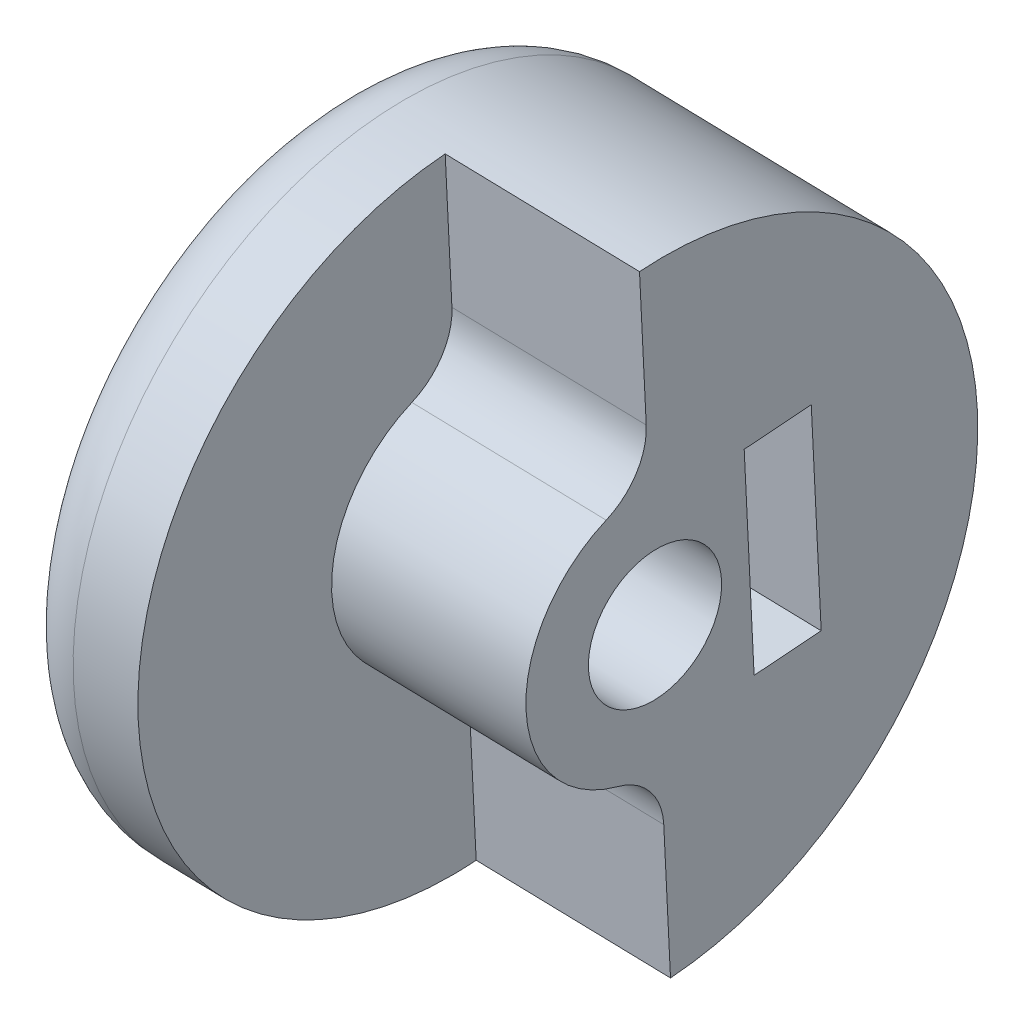
ISO-10303-21;
HEADER;
FILE_DESCRIPTION(('STEP AP214'),'2;1');
FILE_NAME('part.step','',(''),(''),'','','');
FILE_SCHEMA(('AUTOMOTIVE_DESIGN { 1 0 10303 214 1 1 1 1 }'));
ENDSEC;
DATA;
#1=APPLICATION_CONTEXT('core data for automotive mechanical design processes');
#2=APPLICATION_PROTOCOL_DEFINITION('international standard','automotive_design',2000,#1);
#3=PRODUCT_CONTEXT('',#1,'mechanical');
#4=PRODUCT('Part','Part','',(#3));
#5=PRODUCT_RELATED_PRODUCT_CATEGORY('part','',(#4));
#6=PRODUCT_DEFINITION_FORMATION('','',#4);
#7=PRODUCT_DEFINITION_CONTEXT('part definition',#1,'design');
#8=PRODUCT_DEFINITION('design','',#6,#7);
#9=PRODUCT_DEFINITION_SHAPE('','',#8);
#10=(LENGTH_UNIT() NAMED_UNIT(*) SI_UNIT(.MILLI.,.METRE.));
#11=(NAMED_UNIT(*) PLANE_ANGLE_UNIT() SI_UNIT($,.RADIAN.));
#12=(NAMED_UNIT(*) SI_UNIT($,.STERADIAN.) SOLID_ANGLE_UNIT());
#13=UNCERTAINTY_MEASURE_WITH_UNIT(LENGTH_MEASURE(1.E-05),#10,'distance_accuracy_value','');
#14=(GEOMETRIC_REPRESENTATION_CONTEXT(3) GLOBAL_UNCERTAINTY_ASSIGNED_CONTEXT((#13)) GLOBAL_UNIT_ASSIGNED_CONTEXT((#10,
#11,#12)) REPRESENTATION_CONTEXT('',''));
#15=CARTESIAN_POINT('',(0.,0.,0.));
#16=DIRECTION('',(0.,0.,1.));
#17=DIRECTION('',(1.,0.,0.));
#18=AXIS2_PLACEMENT_3D('',#15,#16,#17);
#19=CARTESIAN_POINT('',(326.908154622549,6183.60035002082,3267.18552695112));
#20=DIRECTION('',(0.,-0.074828911130049,0.997196386906356));
#21=DIRECTION('',(0.,-0.997196386906356,-0.074828911130049));
#22=AXIS2_PLACEMENT_3D('',#19,#20,#21);
#23=CYLINDRICAL_SURFACE('',#22,2.24789999999997);
#24=CARTESIAN_POINT('',(326.908154622549,6181.53719533492,3264.63932390312));
#25=CARTESIAN_POINT('',(326.801592501721,6181.53700135156,3264.64200237666));
#26=CARTESIAN_POINT('',(326.694797081448,6181.54495973496,3264.63803854739));
#27=CARTESIAN_POINT('',(326.484722799122,6181.57660648519,3264.61766231055));
#28=CARTESIAN_POINT('',(326.381450478426,6181.60032259846,3264.60122793739));
#29=CARTESIAN_POINT('',(326.182305765981,6181.66145041657,3264.55916119703));
#30=CARTESIAN_POINT('',(326.086371729537,6181.69872813671,3264.53361886119));
#31=CARTESIAN_POINT('',(325.902002458964,6181.78526908347,3264.47675341127));
#32=CARTESIAN_POINT('',(325.813569522156,6181.8345359642,3264.44542853547));
#33=CARTESIAN_POINT('',(325.631912956457,6181.95203187914,3264.37512141387));
#34=CARTESIAN_POINT('',(325.539989196894,6182.02200214434,3264.33569771403));
#35=CARTESIAN_POINT('',(325.367308982668,6182.17484598418,3264.25712971097));
#36=CARTESIAN_POINT('',(325.286565157015,6182.25773392985,3264.21798577033));
#37=CARTESIAN_POINT('',(325.123033863751,6182.45244914375,3264.13618335167));
#38=CARTESIAN_POINT('',(325.042806518761,6182.56677952732,3264.09428353066));
#39=CARTESIAN_POINT('',(324.902665009231,6182.81026440781,3264.02088699577));
#40=CARTESIAN_POINT('',(324.842718640997,6182.93939496314,3263.9893737913));
#41=CARTESIAN_POINT('',(324.758585672514,6183.17539495544,3263.94731971956));
#42=CARTESIAN_POINT('',(324.729217586104,6183.27984306849,3263.93351589625));
#43=CARTESIAN_POINT('',(324.685394353934,6183.49263130316,3263.91593898018));
#44=CARTESIAN_POINT('',(324.670926588781,6183.6009680508,3263.91215739512));
#45=CARTESIAN_POINT('',(324.657771776071,6183.81875320891,3263.91545950715));
#46=CARTESIAN_POINT('',(324.659128253464,6183.92820385776,3263.92257312512));
#47=CARTESIAN_POINT('',(324.6777334189,6184.14449905688,3263.94756845602));
#48=CARTESIAN_POINT('',(324.694984999177,6184.25134312923,3263.96545212844));
#49=CARTESIAN_POINT('',(324.743467468728,6184.45519595152,3264.00994287378));
#50=CARTESIAN_POINT('',(324.774119741904,6184.55242644919,3264.03617778873));
#51=CARTESIAN_POINT('',(324.847874663732,6184.73961495047,3264.09591098513));
#52=CARTESIAN_POINT('',(324.890979700422,6184.82957155495,3264.1294106594));
#53=CARTESIAN_POINT('',(324.992784625307,6185.00907613861,3264.20522132357));
#54=CARTESIAN_POINT('',(325.052576305487,6185.09777508312,3264.24806682379));
#55=CARTESIAN_POINT('',(325.18363017663,6185.26409147076,3264.33760499373));
#56=CARTESIAN_POINT('',(325.254902574354,6185.34169893623,3264.38430106854));
#57=CARTESIAN_POINT('',(325.420761912667,6185.49771775261,3264.48697042373));
#58=CARTESIAN_POINT('',(325.517250411635,6185.57397099441,3264.54315781194));
#59=CARTESIAN_POINT('',(325.72292636564,6185.70998827938,3264.65233437216));
#60=CARTESIAN_POINT('',(325.832115378429,6185.76975029683,3264.70532315065));
#61=CARTESIAN_POINT('',(326.04129986783,6185.86233695339,3264.79338010726));
#62=CARTESIAN_POINT('',(326.139357692101,6185.89808363408,3264.82995489665));
#63=CARTESIAN_POINT('',(326.342324072143,6185.95660799428,3264.89301547523));
#64=CARTESIAN_POINT('',(326.447220999377,6185.97940707896,3264.9195178921));
#65=CARTESIAN_POINT('',(326.663005181575,6186.01092744208,3264.95863521625));
#66=CARTESIAN_POINT('',(326.773945637088,6186.01949110805,3264.97109415622));
#67=CARTESIAN_POINT('',(326.996521515907,6186.02116084276,3264.97899101948));
#68=CARTESIAN_POINT('',(327.108156311079,6186.0142792926,3264.97444257418));
#69=CARTESIAN_POINT('',(327.310161182421,6185.98786231835,3264.95132474825));
#70=CARTESIAN_POINT('',(327.401109436546,6185.97049247532,3264.93507846584));
#71=CARTESIAN_POINT('',(327.578413455694,6185.92600261897,3264.89338118501));
#72=CARTESIAN_POINT('',(327.664763974513,6185.89887173047,3264.8679199196));
#73=CARTESIAN_POINT('',(327.866877727703,6185.82243946869,3264.7982317297));
#74=CARTESIAN_POINT('',(327.979754989732,6185.76861248295,3264.75061502669));
#75=CARTESIAN_POINT('',(328.192886718394,6185.64476553595,3264.64855843431));
#76=CARTESIAN_POINT('',(328.293117923029,6185.57471638658,3264.59410632803));
#77=CARTESIAN_POINT('',(328.481712372192,6185.41794906482,3264.48268004594));
#78=CARTESIAN_POINT('',(328.569827337068,6185.33095155502,3264.42567803733));
#79=CARTESIAN_POINT('',(328.730360695437,6185.14186858893,3264.31485192362));
#80=CARTESIAN_POINT('',(328.80279896524,6185.03980251755,3264.2610238581));
#81=CARTESIAN_POINT('',(328.92079786094,6184.83692685845,3264.1678729962));
#82=CARTESIAN_POINT('',(328.96869971279,6184.73793420825,3264.12757433765));
#83=CARTESIAN_POINT('',(329.049269504324,6184.5310845872,3264.05522505858));
#84=CARTESIAN_POINT('',(329.081946256191,6184.42323278659,3264.02316967173));
#85=CARTESIAN_POINT('',(329.130412212972,6184.20053350462,3263.96951906837));
#86=CARTESIAN_POINT('',(329.146101840351,6184.08564890005,3263.94798593201));
#87=CARTESIAN_POINT('',(329.159091157402,6183.85321915758,3263.91730856518));
#88=CARTESIAN_POINT('',(329.156398923672,6183.73567521076,3263.9081588958));
#89=CARTESIAN_POINT('',(329.133929096206,6183.51388209455,3263.9028531634));
#90=CARTESIAN_POINT('',(329.115885204089,6183.40947786991,3263.90549034932));
#91=CARTESIAN_POINT('',(329.065916290158,6183.20478079,3263.92036397312));
#92=CARTESIAN_POINT('',(329.033988922053,6183.1044886328,3263.9326020338));
#93=CARTESIAN_POINT('',(328.956530145964,6182.90742944018,3263.96580392248));
#94=CARTESIAN_POINT('',(328.910628837796,6182.81085075933,3263.98701202959));
#95=CARTESIAN_POINT('',(328.807240654171,6182.62606124605,3264.03625647277));
#96=CARTESIAN_POINT('',(328.749751427457,6182.53785211721,3264.06429419485));
#97=CARTESIAN_POINT('',(328.615180652779,6182.35822283063,3264.12970157568));
#98=CARTESIAN_POINT('',(328.536452526709,6182.26831817971,3264.16784066032));
#99=CARTESIAN_POINT('',(328.367003711242,6182.1018432549,3264.24708702399));
#100=CARTESIAN_POINT('',(328.276259151143,6182.02530024454,3264.28820013517));
#101=CARTESIAN_POINT('',(328.069219224722,6181.87623655246,3264.37579037961));
#102=CARTESIAN_POINT('',(327.951136622067,6181.80609469243,3264.42213323403));
#103=CARTESIAN_POINT('',(327.701771128719,6181.68791047372,3264.50653934301));
#104=CARTESIAN_POINT('',(327.570531115215,6181.63979900407,3264.54462828985));
#105=CARTESIAN_POINT('',(327.349371083599,6181.58280613649,3264.59280267626));
#106=CARTESIAN_POINT('',(327.262614039742,6181.56596867252,3264.6080307229));
#107=CARTESIAN_POINT('',(327.086675521831,6181.54325112427,3264.6301635491));
#108=CARTESIAN_POINT('',(326.99749706838,6181.53735797196,3264.6370782517));
#109=CARTESIAN_POINT('',(326.908154622549,6181.53719533492,3264.63932390312));
#110=B_SPLINE_CURVE_WITH_KNOTS('',3,(#24,#25,#26,#27,#28,#29,#30,#31,#32,#33,#34,#35,#36,#37,
#38,#39,#40,#41,#42,#43,#44,#45,#46,#47,#48,#49,#50,#51,#52,#53,#54,#55,#56,#57,#58,#59,#60,#61,
#62,#63,#64,#65,#66,#67,#68,#69,#70,#71,#72,#73,#74,#75,#76,#77,#78,#79,#80,#81,#82,#83,#84,#85,
#86,#87,#88,#89,#90,#91,#92,#93,#94,#95,#96,#97,#98,#99,#100,#101,#102,#103,#104,#105,#106,#107,
#108,#109),.UNSPECIFIED.,.T.,.F.,(4,2,2,2,2,2,2,2,2,2,2,2,2,2,2,2,2,2,2,2,2,2,2,2,2,2,2,2,2,2,2,
2,2,2,2,2,2,2,2,2,2,2,4),(0.,0.319379632697999,0.639323129553901,0.95618790379326,
1.27314937467175,1.63807175667907,2.00340305453204,2.43857403087845,2.87305073000711,
3.19977683762745,3.52622600597208,3.85357329161145,4.18098015231262,4.49546475794108,
4.81000971160984,5.15440688942225,5.49911195567997,5.90311212604608,6.30716190043551,
6.63775271146785,6.96779538137788,7.30146847331985,7.63487418403738,7.91572597280686,
8.19689164398122,8.59619305429314,8.99621857716629,9.40350089364732,9.81026375610438,
10.1601938246728,10.5099211037268,10.8616875457264,11.2132994389808,11.5297851916631,
11.8463244508841,12.1721035495618,12.4979488174217,12.872845074822,13.2484975618772,
13.681235158515,14.1126057650117,14.3806962570215,14.648466430065),.UNSPECIFIED.);
#111=CARTESIAN_POINT('',(326.908154622549,6181.53719533492,3264.63932390312));
#112=VERTEX_POINT('',#111);
#113=EDGE_CURVE('E159',#112,#112,#110,.T.);
#114=ORIENTED_EDGE('',*,*,#113,.F.);
#115=EDGE_LOOP('',(#114));
#116=FACE_BOUND('',#115,.T.);
#117=CARTESIAN_POINT('',(326.908154622549,6183.94721943836,3262.56302309962));
#118=DIRECTION('',(0.,0.0748289111300478,-0.997196386906356));
#119=DIRECTION('',(0.,0.997196386906356,0.0748289111300478));
#120=AXIS2_PLACEMENT_3D('',#117,#118,#119);
#121=CIRCLE('',#120,2.24789999999997);
#122=CARTESIAN_POINT('',(326.908154622549,6186.18881719649,3262.73123100895));
#123=VERTEX_POINT('',#122);
#124=EDGE_CURVE('E154',#123,#123,#121,.F.);
#125=ORIENTED_EDGE('',*,*,#124,.F.);
#126=EDGE_LOOP('',(#125));
#127=FACE_BOUND('',#126,.T.);
#128=ADVANCED_FACE('F34',(#116,#127),#23,.F.);
#129=CARTESIAN_POINT('',(320.560448237722,6183.77052809832,3267.19829699361));
#130=DIRECTION('',(-0.999638800759929,0.0267996972431761,0.00201103031422804));
#131=DIRECTION('',(0.00201175288836806,0.,0.999997976423111));
#132=AXIS2_PLACEMENT_3D('',#129,#130,#131);
#133=TOROIDAL_SURFACE('',#132,12.6999999999996,3.175);
#134=CARTESIAN_POINT('',(317.386595045309,6183.85561713707,3267.20468201486));
#135=DIRECTION('',(0.999638800759929,-0.0267996972431761,-0.00201103031422804));
#136=DIRECTION('',(0.0267997514355812,0.999640822157134,-6.29417777740183E-13));
#137=AXIS2_PLACEMENT_3D('',#134,#135,#136);
#138=CIRCLE('',#137,12.7000000000013);
#139=CARTESIAN_POINT('',(317.726951888541,6196.55105557846,3267.20468201485));
#140=VERTEX_POINT('',#139);
#141=EDGE_CURVE('E222',#140,#140,#138,.T.);
#142=ORIENTED_EDGE('',*,*,#141,.T.);
#143=EDGE_LOOP('',(#142));
#144=FACE_BOUND('',#143,.T.);
#145=CARTESIAN_POINT('',(320.560448237721,6183.77052809833,3267.1982969936));
#146=DIRECTION('',(-0.999638800759929,0.0267996972431899,0.00201103031419884));
#147=DIRECTION('',(-0.0267997514355973,-0.999640822157134,0.));
#148=AXIS2_PLACEMENT_3D('',#145,#146,#147);
#149=CIRCLE('',#148,15.8749999999998);
#150=CARTESIAN_POINT('',(320.135002183681,6167.90123004658,3267.1982969936));
#151=VERTEX_POINT('',#150);
#152=EDGE_CURVE('E249',#151,#151,#149,.T.);
#153=ORIENTED_EDGE('',*,*,#152,.T.);
#154=EDGE_LOOP('',(#153));
#155=FACE_BOUND('',#154,.T.);
#156=ADVANCED_FACE('F176',(#144,#155),#133,.T.);
#157=CARTESIAN_POINT('',(321.466716884046,6334.52205534716,3287.50928548159));
#158=DIRECTION('',(-0.999638800759929,0.0267996972431761,0.00201103031422804));
#159=DIRECTION('',(-0.0267997514355835,-0.999640822157134,0.));
#160=AXIS2_PLACEMENT_3D('',#157,#158,#159);
#161=PLANE('',#160);
#162=ORIENTED_EDGE('',*,*,#141,.F.);
#163=EDGE_LOOP('',(#162));
#164=FACE_BOUND('',#163,.T.);
#165=ADVANCED_FACE('F36',(#164),#161,.T.);
#166=CARTESIAN_POINT('',(327.814423268872,6334.35187726969,3287.49651543908));
#167=DIRECTION('',(-0.999638800759929,0.0267996972431761,0.00201103031422804));
#168=DIRECTION('',(-0.0267997514355835,-0.999640822157134,0.));
#169=AXIS2_PLACEMENT_3D('',#166,#167,#168);
#170=PLANE('',#169);
#171=CARTESIAN_POINT('',(323.734301430129,6183.68543905958,3267.19191197235));
#172=DIRECTION('',(0.999638800759928,-0.0267996972432226,-0.00201103031425039));
#173=DIRECTION('',(0.02679975143563,0.999640822157133,0.));
#174=AXIS2_PLACEMENT_3D('',#171,#172,#173);
#175=CIRCLE('',#174,6.3499999999999);
#176=CARTESIAN_POINT('',(323.895197951865,6189.49494745749,3269.75047103633));
#177=VERTEX_POINT('',#176);
#178=CARTESIAN_POINT('',(323.573404908396,6177.55915493788,3268.85481761295));
#179=VERTEX_POINT('',#178);
#180=EDGE_CURVE('E280',#177,#179,#175,.T.);
#181=ORIENTED_EDGE('',*,*,#180,.F.);
#182=CARTESIAN_POINT('',(323.975646212733,6192.39970165645,3271.02975056831));
#183=DIRECTION('',(0.999638800759928,-0.0267996972432226,-0.00201103031425039));
#184=DIRECTION('',(0.02679975143563,0.999640822157133,0.));
#185=AXIS2_PLACEMENT_3D('',#182,#183,#184);
#186=CIRCLE('',#185,3.175);
#187=CARTESIAN_POINT('',(323.975646212737,6192.63728344928,3267.86365203989));
#188=VERTEX_POINT('',#187);
#189=EDGE_CURVE('E274',#188,#177,#186,.F.);
#190=ORIENTED_EDGE('',*,*,#189,.F.);
#191=DIRECTION('',(-0.0268750444695199,-0.996836200329253,-0.07480188298364));
#192=VECTOR('',#191,1.);
#193=CARTESIAN_POINT('',(324.160942761093,6199.51021373979,3268.37939186472));
#194=LINE('',#193,#192);
#195=CARTESIAN_POINT('',(324.160942761093,6199.51021373981,3268.37939186472));
#196=VERTEX_POINT('',#195);
#197=EDGE_CURVE('E272',#196,#188,#194,.T.);
#198=ORIENTED_EDGE('',*,*,#197,.F.);
#199=CARTESIAN_POINT('',(323.734301430138,6183.68543905958,3267.19191197235));
#200=DIRECTION('',(-0.999638800759929,0.0267996972431899,0.00201103031419884));
#201=DIRECTION('',(-0.0267997514355973,-0.999640822157134,0.));
#202=AXIS2_PLACEMENT_3D('',#199,#200,#201);
#203=CIRCLE('',#202,15.8749999999998);
#204=CARTESIAN_POINT('',(323.307660099182,6167.86066437935,3266.00443207999));
#205=VERTEX_POINT('',#204);
#206=EDGE_CURVE('E246',#205,#196,#203,.T.);
#207=ORIENTED_EDGE('',*,*,#206,.F.);
#208=DIRECTION('',(-0.0268750444695199,-0.996836200329253,-0.07480188298364));
#209=VECTOR('',#208,1.);
#210=CARTESIAN_POINT('',(323.492956647532,6174.73359466986,3266.52017190482));
#211=LINE('',#210,#209);
#212=CARTESIAN_POINT('',(323.492956647532,6174.73359466986,3266.52017190482));
#213=VERTEX_POINT('',#212);
#214=EDGE_CURVE('E218',#213,#205,#211,.T.);
#215=ORIENTED_EDGE('',*,*,#214,.F.);
#216=CARTESIAN_POINT('',(323.492956647533,6174.49601287703,3269.68627043325));
#217=DIRECTION('',(-0.999638800759928,0.0267996972432226,0.00201103031425039));
#218=DIRECTION('',(-0.02679975143563,-0.999640822157133,0.));
#219=AXIS2_PLACEMENT_3D('',#216,#217,#218);
#220=CIRCLE('',#219,3.175);
#221=EDGE_CURVE('E278',#179,#213,#220,.T.);
#222=ORIENTED_EDGE('',*,*,#221,.F.);
#223=EDGE_LOOP('',(#181,#190,#198,#207,#215,#222));
#224=FACE_BOUND('',#223,.T.);
#225=ADVANCED_FACE('F312',(#224),#170,.F.);
#226=CARTESIAN_POINT('',(324.160942761093,6199.51021373979,3268.37939186472));
#227=DIRECTION('',(0.,-0.0748289111294746,0.997196386906399));
#228=DIRECTION('',(0.,-0.997196386906399,-0.0748289111294746));
#229=AXIS2_PLACEMENT_3D('',#226,#227,#228);
#230=PLANE('',#229);
#231=DIRECTION('',(-0.999638800759929,0.0267996972431738,0.00201103031419689));
#232=VECTOR('',#231,1.);
#233=CARTESIAN_POINT('',(333.682502338332,6199.25494662357,3268.36023680098));
#234=LINE('',#233,#232);
#235=CARTESIAN_POINT('',(333.682502338332,6199.25494662357,3268.36023680097));
#236=VERTEX_POINT('',#235);
#237=EDGE_CURVE('E244',#236,#196,#234,.T.);
#238=ORIENTED_EDGE('',*,*,#237,.T.);
#239=ORIENTED_EDGE('',*,*,#197,.T.);
#240=DIRECTION('',(0.999638800759944,-0.0267996972426213,-0.00201103031419741));
#241=VECTOR('',#240,1.);
#242=CARTESIAN_POINT('',(323.975646212741,6192.63728344928,3267.86365203988));
#243=LINE('',#242,#241);
#244=CARTESIAN_POINT('',(333.497205789977,6192.38201633304,3267.84449697614));
#245=VERTEX_POINT('',#244);
#246=EDGE_CURVE('E268',#188,#245,#243,.T.);
#247=ORIENTED_EDGE('',*,*,#246,.T.);
#248=DIRECTION('',(-0.0268750444697461,-0.996836200329281,-0.0748018829831912));
#249=VECTOR('',#248,1.);
#250=CARTESIAN_POINT('',(333.682502338331,6199.25494662355,3268.36023680097));
#251=LINE('',#250,#249);
#252=EDGE_CURVE('E264',#236,#245,#251,.T.);
#253=ORIENTED_EDGE('',*,*,#252,.F.);
#254=EDGE_LOOP('',(#238,#239,#247,#253));
#255=FACE_BOUND('',#254,.T.);
#256=ADVANCED_FACE('F307',(#255),#230,.T.);
#257=CARTESIAN_POINT('',(333.255861007374,6183.43017194332,3267.17275690863));
#258=DIRECTION('',(0.999638800759929,-0.0267996972431761,-0.00201103031422804));
#259=DIRECTION('',(0.0267997514355835,0.999640822157134,0.));
#260=AXIS2_PLACEMENT_3D('',#257,#258,#259);
#261=PLANE('',#260);
#262=DIRECTION('',(-0.0268750444697404,-0.996836200329198,-0.0748018829843015));
#263=VECTOR('',#262,1.);
#264=CARTESIAN_POINT('',(333.363374622775,6188.01196964483,3259.55675552042));
#265=LINE('',#264,#263);
#266=CARTESIAN_POINT('',(333.392386233281,6189.08805432309,3259.63750415312));
#267=VERTEX_POINT('',#266);
#268=CARTESIAN_POINT('',(333.119335781468,6178.96019852775,3258.877517022));
#269=VERTEX_POINT('',#268);
#270=EDGE_CURVE('E271',#267,#269,#265,.T.);
#271=ORIENTED_EDGE('',*,*,#270,.T.);
#272=DIRECTION('',(0.,0.0748289111300486,-0.997196386906356));
#273=VECTOR('',#272,1.);
#274=CARTESIAN_POINT('',(333.119335781468,6178.36624404565,3266.79276334307));
#275=LINE('',#274,#273);
#276=CARTESIAN_POINT('',(333.119335781468,6178.7131134632,3262.17025949156));
#277=VERTEX_POINT('',#276);
#278=EDGE_CURVE('E11',#277,#269,#275,.T.);
#279=ORIENTED_EDGE('',*,*,#278,.F.);
#280=DIRECTION('',(0.0268750444697427,0.996836200329204,0.0748018829842135));
#281=VECTOR('',#280,1.);
#282=CARTESIAN_POINT('',(333.255861007374,6183.77704136086,3262.55025305712));
#283=LINE('',#282,#281);
#284=CARTESIAN_POINT('',(333.392386233281,6188.84096925854,3262.93024662268));
#285=VERTEX_POINT('',#284);
#286=EDGE_CURVE('E156',#277,#285,#283,.T.);
#287=ORIENTED_EDGE('',*,*,#286,.T.);
#288=DIRECTION('',(0.,-0.0748289111300486,0.997196386906356));
#289=VECTOR('',#288,1.);
#290=CARTESIAN_POINT('',(333.392386233281,6188.494099841,3267.55275047419));
#291=LINE('',#290,#289);
#292=EDGE_CURVE('E44',#267,#285,#291,.T.);
#293=ORIENTED_EDGE('',*,*,#292,.F.);
#294=EDGE_LOOP('',(#271,#279,#287,#293));
#295=FACE_BOUND('',#294,.T.);
#296=CARTESIAN_POINT('',(333.255861007374,6183.43017194332,3267.17275690863));
#297=DIRECTION('',(-0.999638800759929,0.02679969724319,0.00201103031424361));
#298=DIRECTION('',(-0.0267997514355973,-0.999640822157134,0.));
#299=AXIS2_PLACEMENT_3D('',#296,#297,#298);
#300=CIRCLE('',#299,3.27660000000038);
#301=CARTESIAN_POINT('',(333.16804894182,6180.15474882544,3267.17275690863));
#302=VERTEX_POINT('',#301);
#303=EDGE_CURVE('E267',#302,#302,#300,.T.);
#304=ORIENTED_EDGE('',*,*,#303,.T.);
#305=EDGE_LOOP('',(#304));
#306=FACE_BOUND('',#305,.T.);
#307=DIRECTION('',(0.0268750444698936,0.996836200329247,0.0748018829835848));
#308=VECTOR('',#307,1.);
#309=CARTESIAN_POINT('',(332.829219676417,6167.60539726311,3265.98527701625));
#310=LINE('',#309,#308);
#311=CARTESIAN_POINT('',(332.829219676416,6167.60539726311,3265.98527701625));
#312=VERTEX_POINT('',#311);
#313=CARTESIAN_POINT('',(333.014516224771,6174.47832755362,3266.50101684108));
#314=VERTEX_POINT('',#313);
#315=EDGE_CURVE('E269',#312,#314,#310,.T.);
#316=ORIENTED_EDGE('',*,*,#315,.F.);
#317=CARTESIAN_POINT('',(333.255861007375,6183.43017194334,3267.1727569086));
#318=DIRECTION('',(-0.999638800759929,0.0267996972431899,0.00201103031419884));
#319=DIRECTION('',(-0.0267997514355973,-0.999640822157134,0.));
#320=AXIS2_PLACEMENT_3D('',#317,#318,#319);
#321=CIRCLE('',#320,15.8749999999998);
#322=EDGE_CURVE('E236',#236,#312,#321,.T.);
#323=ORIENTED_EDGE('',*,*,#322,.F.);
#324=ORIENTED_EDGE('',*,*,#252,.T.);
#325=CARTESIAN_POINT('',(333.497205789977,6192.14443454021,3271.01059550457));
#326=DIRECTION('',(0.999638800759928,-0.0267996972432226,-0.00201103031425039));
#327=DIRECTION('',(0.02679975143563,0.999640822157133,0.));
#328=AXIS2_PLACEMENT_3D('',#325,#326,#327);
#329=CIRCLE('',#328,3.175);
#330=CARTESIAN_POINT('',(333.416757529111,6189.23968034125,3269.73131597259));
#331=VERTEX_POINT('',#330);
#332=EDGE_CURVE('E270',#245,#331,#329,.F.);
#333=ORIENTED_EDGE('',*,*,#332,.T.);
#334=CARTESIAN_POINT('',(333.255861007376,6183.43017194334,3267.1727569086));
#335=DIRECTION('',(0.999638800759928,-0.0267996972432226,-0.00201103031425039));
#336=DIRECTION('',(0.02679975143563,0.999640822157133,0.));
#337=AXIS2_PLACEMENT_3D('',#334,#335,#336);
#338=CIRCLE('',#337,6.3499999999999);
#339=CARTESIAN_POINT('',(333.09496448564,6177.30388782163,3268.83566254921));
#340=VERTEX_POINT('',#339);
#341=EDGE_CURVE('E290',#331,#340,#338,.T.);
#342=ORIENTED_EDGE('',*,*,#341,.T.);
#343=CARTESIAN_POINT('',(333.014516224772,6174.24074576079,3269.66711536951));
#344=DIRECTION('',(-0.999638800759928,0.0267996972432226,0.00201103031425039));
#345=DIRECTION('',(-0.02679975143563,-0.999640822157133,0.));
#346=AXIS2_PLACEMENT_3D('',#343,#344,#345);
#347=CIRCLE('',#346,3.175);
#348=EDGE_CURVE('E292',#340,#314,#347,.T.);
#349=ORIENTED_EDGE('',*,*,#348,.T.);
#350=EDGE_LOOP('',(#316,#323,#324,#333,#342,#349));
#351=FACE_BOUND('',#350,.T.);
#352=ADVANCED_FACE('F304',(#295,#306,#351),#261,.T.);
#353=CARTESIAN_POINT('',(333.363374622776,6188.01196964483,3259.55675552042));
#354=DIRECTION('',(0.,0.0748289111288952,-0.997196386906443));
#355=DIRECTION('',(0.,0.997196386906443,0.0748289111288952));
#356=AXIS2_PLACEMENT_3D('',#353,#354,#355);
#357=PLANE('',#356);
#358=DIRECTION('',(-0.999638800759923,0.0267996972433878,0.00201103031427132));
#359=VECTOR('',#358,1.);
#360=CARTESIAN_POINT('',(333.838880165489,6178.94090798837,3258.87606947358));
#361=LINE('',#360,#359);
#362=CARTESIAN_POINT('',(323.83974940463,6179.20897849232,3258.89618529447));
#363=VERTEX_POINT('',#362);
#364=EDGE_CURVE('E140',#269,#363,#361,.T.);
#365=ORIENTED_EDGE('',*,*,#364,.F.);
#366=ORIENTED_EDGE('',*,*,#270,.F.);
#367=DIRECTION('',(0.999638800759928,-0.0267996972432089,-0.00201103031422682));
#368=VECTOR('',#367,1.);
#369=CARTESIAN_POINT('',(324.112799856442,6189.33683428767,3259.65617242559));
#370=LINE('',#369,#368);
#371=CARTESIAN_POINT('',(324.112799856442,6189.33683428767,3259.65617242559));
#372=VERTEX_POINT('',#371);
#373=EDGE_CURVE('E142',#372,#267,#370,.T.);
#374=ORIENTED_EDGE('',*,*,#373,.F.);
#375=DIRECTION('',(0.523093871618623,0.84988562427544,0.0637748157581389));
#376=VECTOR('',#375,1.);
#377=CARTESIAN_POINT('',(321.044394638524,6184.35150827708,3259.28207709001));
#378=LINE('',#377,#376);
#379=CARTESIAN_POINT('',(321.044394638524,6184.35150827708,3259.28207709001));
#380=VERTEX_POINT('',#379);
#381=EDGE_CURVE('E148',#380,#372,#378,.T.);
#382=ORIENTED_EDGE('',*,*,#381,.F.);
#383=DIRECTION('',(-0.476544929141307,0.876685321518646,0.0657858460723405));
#384=VECTOR('',#383,1.);
#385=CARTESIAN_POINT('',(323.83974940463,6179.20897849232,3258.89618529447));
#386=LINE('',#385,#384);
#387=EDGE_CURVE('E121',#363,#380,#386,.T.);
#388=ORIENTED_EDGE('',*,*,#387,.F.);
#389=EDGE_LOOP('',(#365,#366,#374,#382,#388));
#390=FACE_BOUND('',#389,.T.);
#391=CARTESIAN_POINT('',(326.908154622549,6184.19430450291,3259.27028063004));
#392=DIRECTION('',(0.,0.0748289111288952,-0.997196386906443));
#393=DIRECTION('',(0.,0.997196386906443,0.0748289111288952));
#394=AXIS2_PLACEMENT_3D('',#391,#392,#393);
#395=CIRCLE('',#394,2.24789999999997);
#396=CARTESIAN_POINT('',(326.908154622549,6186.43590226104,3259.43848853936));
#397=VERTEX_POINT('',#396);
#398=EDGE_CURVE('E168',#397,#397,#395,.T.);
#399=ORIENTED_EDGE('',*,*,#398,.T.);
#400=EDGE_LOOP('',(#399));
#401=FACE_BOUND('',#400,.T.);
#402=ADVANCED_FACE('F315',(#390,#401),#357,.F.);
#403=CARTESIAN_POINT('',(324.160942761093,6199.51021373979,3268.37939186472));
#404=DIRECTION('',(0.,-0.0748289111294746,0.997196386906399));
#405=DIRECTION('',(0.,-0.997196386906399,-0.0748289111294746));
#406=AXIS2_PLACEMENT_3D('',#403,#404,#405);
#407=PLANE('',#406);
#408=DIRECTION('',(-0.999638800759929,0.0267996972431899,0.00201103031419884));
#409=VECTOR('',#408,1.);
#410=CARTESIAN_POINT('',(323.307660099178,6167.86066437935,3266.00443208));
#411=LINE('',#410,#409);
#412=EDGE_CURVE('E51',#312,#205,#411,.T.);
#413=ORIENTED_EDGE('',*,*,#412,.F.);
#414=ORIENTED_EDGE('',*,*,#315,.T.);
#415=DIRECTION('',(-0.999638800759939,0.0267996972428005,0.00201103031419686));
#416=VECTOR('',#415,1.);
#417=CARTESIAN_POINT('',(333.014516224771,6174.47832755362,3266.50101684108));
#418=LINE('',#417,#416);
#419=EDGE_CURVE('E295',#314,#213,#418,.T.);
#420=ORIENTED_EDGE('',*,*,#419,.T.);
#421=ORIENTED_EDGE('',*,*,#214,.T.);
#422=EDGE_LOOP('',(#413,#414,#420,#421));
#423=FACE_BOUND('',#422,.T.);
#424=ADVANCED_FACE('F313',(#423),#407,.T.);
#425=CARTESIAN_POINT('',(323.492956647532,6174.49601287703,3269.68627043325));
#426=DIRECTION('',(-0.999638800759928,0.0267996972432226,0.00201103031425039));
#427=DIRECTION('',(-0.02679975143563,-0.999640822157133,0.));
#428=AXIS2_PLACEMENT_3D('',#425,#426,#427);
#429=CYLINDRICAL_SURFACE('',#428,3.175);
#430=ORIENTED_EDGE('',*,*,#419,.F.);
#431=ORIENTED_EDGE('',*,*,#348,.F.);
#432=DIRECTION('',(-0.999638800759928,0.0267996972432226,0.00201103031425039));
#433=VECTOR('',#432,1.);
#434=CARTESIAN_POINT('',(323.5734049084,6177.55915493788,3268.85481761295));
#435=LINE('',#434,#433);
#436=EDGE_CURVE('E260',#179,#340,#435,.F.);
#437=ORIENTED_EDGE('',*,*,#436,.F.);
#438=ORIENTED_EDGE('',*,*,#221,.T.);
#439=EDGE_LOOP('',(#430,#431,#437,#438));
#440=FACE_BOUND('',#439,.T.);
#441=ADVANCED_FACE('F197',(#440),#429,.F.);
#442=CARTESIAN_POINT('',(333.255861007374,6183.43017194332,3267.17275690863));
#443=DIRECTION('',(-0.999638800759929,0.02679969724319,0.00201103031424361));
#444=DIRECTION('',(-0.0267997514355973,-0.999640822157134,0.));
#445=AXIS2_PLACEMENT_3D('',#442,#443,#444);
#446=CYLINDRICAL_SURFACE('',#445,3.27660000000038);
#447=ORIENTED_EDGE('',*,*,#113,.T.);
#448=EDGE_LOOP('',(#447));
#449=FACE_BOUND('',#448,.T.);
#450=ORIENTED_EDGE('',*,*,#303,.F.);
#451=EDGE_LOOP('',(#450));
#452=FACE_BOUND('',#451,.T.);
#453=CARTESIAN_POINT('',(320.560448237724,6183.77052809831,3267.19829699362));
#454=DIRECTION('',(-0.999638800759929,0.02679969724319,0.00201103031424361));
#455=DIRECTION('',(-0.0267997514355973,-0.999640822157134,0.));
#456=AXIS2_PLACEMENT_3D('',#453,#454,#455);
#457=CIRCLE('',#456,3.27660000000038);
#458=CARTESIAN_POINT('',(320.47263617217,6180.49510498043,3267.19829699362));
#459=VERTEX_POINT('',#458);
#460=EDGE_CURVE('E255',#459,#459,#457,.F.);
#461=ORIENTED_EDGE('',*,*,#460,.F.);
#462=EDGE_LOOP('',(#461));
#463=FACE_BOUND('',#462,.T.);
#464=ADVANCED_FACE('F191',(#449,#452,#463),#446,.F.);
#465=CARTESIAN_POINT('',(323.975646212741,6192.39970165645,3271.02975056831));
#466=DIRECTION('',(0.999638800759928,-0.0267996972432226,-0.00201103031425039));
#467=DIRECTION('',(0.02679975143563,0.999640822157133,0.));
#468=AXIS2_PLACEMENT_3D('',#465,#466,#467);
#469=CYLINDRICAL_SURFACE('',#468,3.175);
#470=DIRECTION('',(0.999638800759928,-0.0267996972432226,-0.00201103031425039));
#471=VECTOR('',#470,1.);
#472=CARTESIAN_POINT('',(323.895197951871,6189.49494745749,3269.75047103634));
#473=LINE('',#472,#471);
#474=EDGE_CURVE('E251',#331,#177,#473,.F.);
#475=ORIENTED_EDGE('',*,*,#474,.F.);
#476=ORIENTED_EDGE('',*,*,#332,.F.);
#477=ORIENTED_EDGE('',*,*,#246,.F.);
#478=ORIENTED_EDGE('',*,*,#189,.T.);
#479=EDGE_LOOP('',(#475,#476,#477,#478));
#480=FACE_BOUND('',#479,.T.);
#481=ADVANCED_FACE('F196',(#480),#469,.F.);
#482=CARTESIAN_POINT('',(323.734301430135,6183.68543905958,3267.19191197235));
#483=DIRECTION('',(0.999638800759928,-0.0267996972432226,-0.00201103031425039));
#484=DIRECTION('',(0.02679975143563,0.999640822157133,0.));
#485=AXIS2_PLACEMENT_3D('',#482,#483,#484);
#486=CYLINDRICAL_SURFACE('',#485,6.3499999999999);
#487=ORIENTED_EDGE('',*,*,#474,.T.);
#488=ORIENTED_EDGE('',*,*,#180,.T.);
#489=ORIENTED_EDGE('',*,*,#436,.T.);
#490=ORIENTED_EDGE('',*,*,#341,.F.);
#491=EDGE_LOOP('',(#487,#488,#489,#490));
#492=FACE_BOUND('',#491,.T.);
#493=ADVANCED_FACE('F202',(#492),#486,.T.);
#494=CARTESIAN_POINT('',(320.551470110007,6183.7930144598,3262.43580662397));
#495=DIRECTION('',(0.999638800759929,-0.0267996972431761,-0.00201103031422804));
#496=DIRECTION('',(0.0267997514355835,0.999640822157134,0.));
#497=AXIS2_PLACEMENT_3D('',#494,#495,#496);
#498=PLANE('',#497);
#499=ORIENTED_EDGE('',*,*,#460,.T.);
#500=EDGE_LOOP('',(#499));
#501=FACE_BOUND('',#500,.T.);
#502=ADVANCED_FACE('F206',(#501),#498,.T.);
#503=CARTESIAN_POINT('',(323.734301430135,6183.68543905958,3267.19191197235));
#504=DIRECTION('',(-0.999638800759929,0.0267996972431899,0.00201103031419884));
#505=DIRECTION('',(-0.0267997514355973,-0.999640822157134,0.));
#506=AXIS2_PLACEMENT_3D('',#503,#504,#505);
#507=CYLINDRICAL_SURFACE('',#506,15.8749999999998);
#508=CARTESIAN_POINT('',(326.908154622549,6182.53470049379,3251.34621933539));
#509=CARTESIAN_POINT('',(326.782642988294,6182.53466976717,3251.34669868068));
#510=CARTESIAN_POINT('',(326.657051055706,6182.54525966784,3251.34645736573));
#511=CARTESIAN_POINT('',(326.409360603113,6182.58740299357,3251.34462023666));
#512=CARTESIAN_POINT('',(326.287265657638,6182.61897712271,3251.34302308438));
#513=CARTESIAN_POINT('',(326.050191215365,6182.7021083908,3251.33885863646));
#514=CARTESIAN_POINT('',(325.935206702151,6182.75365125088,3251.33629203408));
#515=CARTESIAN_POINT('',(325.715479079307,6182.87518063652,3251.33080133196));
#516=CARTESIAN_POINT('',(325.610734469706,6182.94516445523,3251.32787728471));
#517=CARTESIAN_POINT('',(325.4137115348,6183.10205346289,3251.32241518557));
#518=CARTESIAN_POINT('',(325.321514639277,6183.18906100529,3251.31987964269));
#519=CARTESIAN_POINT('',(325.152900131653,6183.37724814646,3251.3160436752));
#520=CARTESIAN_POINT('',(325.076483439075,6183.47842857052,3251.31474332254));
#521=CARTESIAN_POINT('',(324.941225474922,6183.69266309942,3251.31415305543));
#522=CARTESIAN_POINT('',(324.882475982426,6183.80577522095,3251.31487344532));
#523=CARTESIAN_POINT('',(324.784793588065,6184.04021097182,3251.31898053357));
#524=CARTESIAN_POINT('',(324.745859845054,6184.16153425236,3251.32236711874));
#525=CARTESIAN_POINT('',(324.689147903589,6184.40814257506,3251.33216209646));
#526=CARTESIAN_POINT('',(324.671243690069,6184.53339935234,3251.33855216469));
#527=CARTESIAN_POINT('',(324.656716584269,6184.78494459748,3251.35441488687));
#528=CARTESIAN_POINT('',(324.660092548996,6184.91123300956,3251.36388737524));
#529=CARTESIAN_POINT('',(324.687917223838,6185.1602323082,3251.3855573239));
#530=CARTESIAN_POINT('',(324.712203861292,6185.28296322406,3251.39773329296));
#531=CARTESIAN_POINT('',(324.780911411213,6185.52240393744,3251.42426250117));
#532=CARTESIAN_POINT('',(324.825332679186,6185.63911362861,3251.43861577875));
#533=CARTESIAN_POINT('',(324.933153307844,6185.86357945295,3251.46867845455));
#534=CARTESIAN_POINT('',(324.996599768329,6185.97131250725,3251.48439114872));
#535=CARTESIAN_POINT('',(325.140633734652,6186.17459379842,3251.51608310636));
#536=CARTESIAN_POINT('',(325.221222251899,6186.27014131578,3251.53206238552));
#537=CARTESIAN_POINT('',(325.398098027535,6186.44728433114,3251.56326535209));
#538=CARTESIAN_POINT('',(325.494518065601,6186.52874869738,3251.57848108951));
#539=CARTESIAN_POINT('',(325.699867365982,6186.67446254244,3251.6068144421));
#540=CARTESIAN_POINT('',(325.808796777921,6186.73871181533,3251.61993203217));
#541=CARTESIAN_POINT('',(326.036319262026,6186.84829954918,3251.64301247825));
#542=CARTESIAN_POINT('',(326.154927613739,6186.89360739019,3251.65297021997));
#543=CARTESIAN_POINT('',(326.398286462031,6186.96385618771,3251.66884665186));
#544=CARTESIAN_POINT('',(326.523036587711,6186.98879837249,3251.67476558563));
#545=CARTESIAN_POINT('',(326.774031057216,6187.01746134053,3251.6820068232));
#546=CARTESIAN_POINT('',(326.900254393918,6187.0213566078,3251.68336688527));
#547=CARTESIAN_POINT('',(327.151576847588,6187.00827762669,3251.68146407366));
#548=CARTESIAN_POINT('',(327.276676002092,6186.99130407778,3251.67820135493));
#549=CARTESIAN_POINT('',(327.521521999914,6186.9371296334,3251.66734942004));
#550=CARTESIAN_POINT('',(327.641293506179,6186.90003545674,3251.65978302019));
#551=CARTESIAN_POINT('',(327.872840281331,6186.80674722086,3251.64096249721));
#552=CARTESIAN_POINT('',(327.984615229721,6186.75055239662,3251.62970822638));
#553=CARTESIAN_POINT('',(328.197742962994,6186.62022461922,3251.60433927172));
#554=CARTESIAN_POINT('',(328.299028776788,6186.5459854527,3251.59020773465));
#555=CARTESIAN_POINT('',(328.487630274436,6186.38177015047,3251.56023479291));
#556=CARTESIAN_POINT('',(328.574945210992,6186.29179317349,3251.54439329685));
#557=CARTESIAN_POINT('',(328.733831169763,6186.09775018839,3251.51206131177));
#558=CARTESIAN_POINT('',(328.805272229646,6185.99357839174,3251.49556668121));
#559=CARTESIAN_POINT('',(328.929488286451,6185.77454886726,3251.4632367644));
#560=CARTESIAN_POINT('',(328.982263624572,6185.65969133481,3251.4474014661));
#561=CARTESIAN_POINT('',(329.067497969005,6185.42277153375,3251.41748001448));
#562=CARTESIAN_POINT('',(329.100006106714,6185.30072747963,3251.40338969805));
#563=CARTESIAN_POINT('',(329.143924179017,6185.0526450447,3251.37773104906));
#564=CARTESIAN_POINT('',(329.155335372731,6184.92660690273,3251.36616256602));
#565=CARTESIAN_POINT('',(329.156701810346,6184.67529350093,3251.34614869443));
#566=CARTESIAN_POINT('',(329.146846066743,6184.55002136269,3251.33767656965));
#567=CARTESIAN_POINT('',(329.106356777165,6184.30270618831,3251.32387721129));
#568=CARTESIAN_POINT('',(329.075723406087,6184.18066312502,3251.31854995124));
#569=CARTESIAN_POINT('',(328.994650280209,6183.94346027874,3251.3108802711));
#570=CARTESIAN_POINT('',(328.944240936374,6183.82829023842,3251.30853329138));
#571=CARTESIAN_POINT('',(328.825068156157,6183.60785194916,3251.3063567788));
#572=CARTESIAN_POINT('',(328.756304300903,6183.50258392626,3251.3065273034));
#573=CARTESIAN_POINT('',(328.601726496446,6183.30407062293,3251.30872897773));
#574=CARTESIAN_POINT('',(328.515780167246,6183.21092858836,3251.31077504582));
#575=CARTESIAN_POINT('',(328.329553893257,6183.04027154066,3251.31594088289));
#576=CARTESIAN_POINT('',(328.22927050639,6182.96276029101,3251.31906090995));
#577=CARTESIAN_POINT('',(328.016544988781,6182.82521475512,3251.32555943739));
#578=CARTESIAN_POINT('',(327.904035956212,6182.76528403282,3251.32893932698));
#579=CARTESIAN_POINT('',(327.670570687347,6182.6653439713,3251.33516919338));
#580=CARTESIAN_POINT('',(327.549623461935,6182.62531374132,3251.33801972391));
#581=CARTESIAN_POINT('',(327.341452311184,6182.57557113838,3251.34189348895));
#582=CARTESIAN_POINT('',(327.25552274818,6182.56029091306,3251.34320940419));
#583=CARTESIAN_POINT('',(327.082459900313,6182.53986631576,3251.34520586335));
#584=CARTESIAN_POINT('',(326.995326628444,6182.53472183445,3251.34588641414));
#585=CARTESIAN_POINT('',(326.908154622549,6182.53470049379,3251.34621933539));
#586=B_SPLINE_CURVE_WITH_KNOTS('',3,(#508,#509,#510,#511,#512,#513,#514,#515,#516,#517,#518,
#519,#520,#521,#522,#523,#524,#525,#526,#527,#528,#529,#530,#531,#532,#533,#534,#535,#536,#537,
#538,#539,#540,#541,#542,#543,#544,#545,#546,#547,#548,#549,#550,#551,#552,#553,#554,#555,#556,
#557,#558,#559,#560,#561,#562,#563,#564,#565,#566,#567,#568,#569,#570,#571,#572,#573,#574,#575,
#576,#577,#578,#579,#580,#581,#582,#583,#584,#585),.UNSPECIFIED.,.T.,.F.,(4,2,2,2,2,2,2,2,2,2,2,
2,2,2,2,2,2,2,2,2,2,2,2,2,2,2,2,2,2,2,2,2,2,2,2,2,2,2,4),(0.,0.37621942292945,0.752810595104068,
1.12913297716331,1.50540015151697,1.88400325560067,2.26262841493536,2.64318779764662,
3.02373102491407,3.40198210051002,3.78021285981519,4.15553818281521,4.53087013299425,
4.90713905634451,5.2834301863415,5.66305565117878,6.04268565719314,6.42292700655429,
6.80314542145797,7.18020684233791,7.55725562574723,7.93232384251792,8.30740708334123,
8.68475402645392,9.0621211470402,9.44247246676355,9.82281683350268,10.202235553818,
10.5816316287219,10.9576696718328,11.3337045496641,11.7091634235388,12.0846308665812,
12.4631109985726,12.8416821501436,13.2224405686046,13.602798433111,13.8640981580452,
14.1253950644896),.UNSPECIFIED.);
#587=CARTESIAN_POINT('',(326.908154622549,6182.53470049379,3251.34621933539));
#588=VERTEX_POINT('',#587);
#589=EDGE_CURVE('E160',#588,#588,#586,.T.);
#590=ORIENTED_EDGE('',*,*,#589,.F.);
#591=EDGE_LOOP('',(#590));
#592=FACE_BOUND('',#591,.T.);
#593=ORIENTED_EDGE('',*,*,#152,.F.);
#594=EDGE_LOOP('',(#593));
#595=FACE_BOUND('',#594,.T.);
#596=ORIENTED_EDGE('',*,*,#412,.T.);
#597=ORIENTED_EDGE('',*,*,#206,.T.);
#598=ORIENTED_EDGE('',*,*,#237,.F.);
#599=ORIENTED_EDGE('',*,*,#322,.T.);
#600=EDGE_LOOP('',(#596,#597,#598,#599));
#601=FACE_BOUND('',#600,.T.);
#602=ADVANCED_FACE('F170',(#592,#595,#601),#507,.T.);
#603=ORIENTED_EDGE('',*,*,#589,.T.);
#604=EDGE_LOOP('',(#603));
#605=FACE_BOUND('',#604,.T.);
#606=ORIENTED_EDGE('',*,*,#398,.F.);
#607=EDGE_LOOP('',(#606));
#608=FACE_BOUND('',#607,.T.);
#609=ADVANCED_FACE('F178',(#605,#608),#23,.F.);
#610=CARTESIAN_POINT('',(-1.2038395560513E-10,-208.823397683825,2782.85404033096));
#611=DIRECTION('',(0.,0.0748289111300478,-0.997196386906356));
#612=DIRECTION('',(0.,0.997196386906356,0.0748289111300478));
#613=AXIS2_PLACEMENT_3D('',#610,#611,#612);
#614=PLANE('',#613);
#615=DIRECTION('',(-0.999638800759923,0.0267996972433878,0.00201103031427132));
#616=VECTOR('',#615,1.);
#617=CARTESIAN_POINT('',(333.838880165489,6178.69382292382,3262.16881194314));
#618=LINE('',#617,#616);
#619=CARTESIAN_POINT('',(323.83974940463,6178.96189342777,3262.18892776404));
#620=VERTEX_POINT('',#619);
#621=EDGE_CURVE('E126',#277,#620,#618,.T.);
#622=ORIENTED_EDGE('',*,*,#621,.T.);
#623=DIRECTION('',(-0.476544929141307,0.876685321518646,0.0657858460723405));
#624=VECTOR('',#623,1.);
#625=CARTESIAN_POINT('',(323.83974940463,6178.96189342777,3262.18892776404));
#626=LINE('',#625,#624);
#627=CARTESIAN_POINT('',(321.044394638524,6184.10442321253,3262.57481955957));
#628=VERTEX_POINT('',#627);
#629=EDGE_CURVE('E119',#620,#628,#626,.T.);
#630=ORIENTED_EDGE('',*,*,#629,.T.);
#631=DIRECTION('',(0.523093871618623,0.84988562427544,0.0637748157581389));
#632=VECTOR('',#631,1.);
#633=CARTESIAN_POINT('',(321.044394638524,6184.10442321253,3262.57481955957));
#634=LINE('',#633,#632);
#635=CARTESIAN_POINT('',(324.112799856442,6189.08974922312,3262.94891489515));
#636=VERTEX_POINT('',#635);
#637=EDGE_CURVE('E129',#628,#636,#634,.T.);
#638=ORIENTED_EDGE('',*,*,#637,.T.);
#639=DIRECTION('',(0.999638800759928,-0.0267996972432089,-0.00201103031422682));
#640=VECTOR('',#639,1.);
#641=CARTESIAN_POINT('',(324.112799856442,6189.08974922312,3262.94891489515));
#642=LINE('',#641,#640);
#643=EDGE_CURVE('E134',#636,#285,#642,.T.);
#644=ORIENTED_EDGE('',*,*,#643,.T.);
#645=ORIENTED_EDGE('',*,*,#286,.F.);
#646=EDGE_LOOP('',(#622,#630,#638,#644,#645));
#647=FACE_BOUND('',#646,.T.);
#648=ORIENTED_EDGE('',*,*,#124,.T.);
#649=EDGE_LOOP('',(#648));
#650=FACE_BOUND('',#649,.T.);
#651=ADVANCED_FACE('F136',(#647,#650),#614,.T.);
#652=CARTESIAN_POINT('',(323.83974940463,6178.96189342777,3262.18892776404));
#653=DIRECTION('',(-0.879150118301594,-0.475208881538257,-0.0356593381521904));
#654=DIRECTION('',(0.475511305037564,-0.879709610486024,0.));
#655=AXIS2_PLACEMENT_3D('',#652,#653,#654);
#656=PLANE('',#655);
#657=ORIENTED_EDGE('',*,*,#387,.T.);
#658=DIRECTION('',(0.,0.0748289111300489,-0.997196386906356));
#659=VECTOR('',#658,1.);
#660=CARTESIAN_POINT('',(321.044394638524,6184.10442321253,3262.57481955957));
#661=LINE('',#660,#659);
#662=EDGE_CURVE('E114',#628,#380,#661,.T.);
#663=ORIENTED_EDGE('',*,*,#662,.F.);
#664=ORIENTED_EDGE('',*,*,#629,.F.);
#665=DIRECTION('',(0.,0.0748289111300489,-0.997196386906356));
#666=VECTOR('',#665,1.);
#667=CARTESIAN_POINT('',(323.83974940463,6178.96189342777,3262.18892776404));
#668=LINE('',#667,#666);
#669=EDGE_CURVE('E152',#620,#363,#668,.T.);
#670=ORIENTED_EDGE('',*,*,#669,.T.);
#671=EDGE_LOOP('',(#657,#663,#664,#670));
#672=FACE_BOUND('',#671,.T.);
#673=ADVANCED_FACE('F116',(#672),#656,.F.);
#674=CARTESIAN_POINT('',(333.838880165489,6178.69382292382,3262.16881194314));
#675=DIRECTION('',(-0.026875044469957,-0.996836200329199,-0.074801882984213));
#676=DIRECTION('',(0.,0.074828911130049,-0.997196386906356));
#677=AXIS2_PLACEMENT_3D('',#674,#675,#676);
#678=PLANE('',#677);
#679=ORIENTED_EDGE('',*,*,#278,.T.);
#680=ORIENTED_EDGE('',*,*,#364,.T.);
#681=ORIENTED_EDGE('',*,*,#669,.F.);
#682=ORIENTED_EDGE('',*,*,#621,.F.);
#683=EDGE_LOOP('',(#679,#680,#681,#682));
#684=FACE_BOUND('',#683,.T.);
#685=ADVANCED_FACE('F397',(#684),#678,.F.);
#686=CARTESIAN_POINT('',(324.112799856442,6189.08974922312,3262.94891489515));
#687=DIRECTION('',(0.0268750444697753,0.996836200329203,0.0748018829842134));
#688=DIRECTION('',(0.,-0.074828911130049,0.997196386906356));
#689=AXIS2_PLACEMENT_3D('',#686,#687,#688);
#690=PLANE('',#689);
#691=ORIENTED_EDGE('',*,*,#292,.T.);
#692=ORIENTED_EDGE('',*,*,#643,.F.);
#693=DIRECTION('',(0.,0.0748289111300489,-0.997196386906356));
#694=VECTOR('',#693,1.);
#695=CARTESIAN_POINT('',(324.112799856442,6189.08974922312,3262.94891489515));
#696=LINE('',#695,#694);
#697=EDGE_CURVE('E125',#636,#372,#696,.T.);
#698=ORIENTED_EDGE('',*,*,#697,.T.);
#699=ORIENTED_EDGE('',*,*,#373,.T.);
#700=EDGE_LOOP('',(#691,#692,#698,#699));
#701=FACE_BOUND('',#700,.T.);
#702=ADVANCED_FACE('F405',(#701),#690,.F.);
#703=CARTESIAN_POINT('',(321.044394638524,6184.10442321253,3262.57481955957));
#704=DIRECTION('',(-0.852275073831823,0.521627318790948,0.0391425448320231));
#705=DIRECTION('',(-0.52202738129444,-0.852928726904464,0.));
#706=AXIS2_PLACEMENT_3D('',#703,#704,#705);
#707=PLANE('',#706);
#708=ORIENTED_EDGE('',*,*,#381,.T.);
#709=ORIENTED_EDGE('',*,*,#697,.F.);
#710=ORIENTED_EDGE('',*,*,#637,.F.);
#711=ORIENTED_EDGE('',*,*,#662,.T.);
#712=EDGE_LOOP('',(#708,#709,#710,#711));
#713=FACE_BOUND('',#712,.T.);
#714=ADVANCED_FACE('F130',(#713),#707,.F.);
#715=CLOSED_SHELL('',(#128,#156,#165,#225,#256,#352,#402,#424,#441,#464,#481,#493,#502,#602,
#609,#651,#673,#685,#702,#714));
#716=MANIFOLD_SOLID_BREP('B2',#715);
#717=ADVANCED_BREP_SHAPE_REPRESENTATION('',(#18,#716),#14);
#718=SHAPE_DEFINITION_REPRESENTATION(#9,#717);
ENDSEC;
END-ISO-10303-21;
